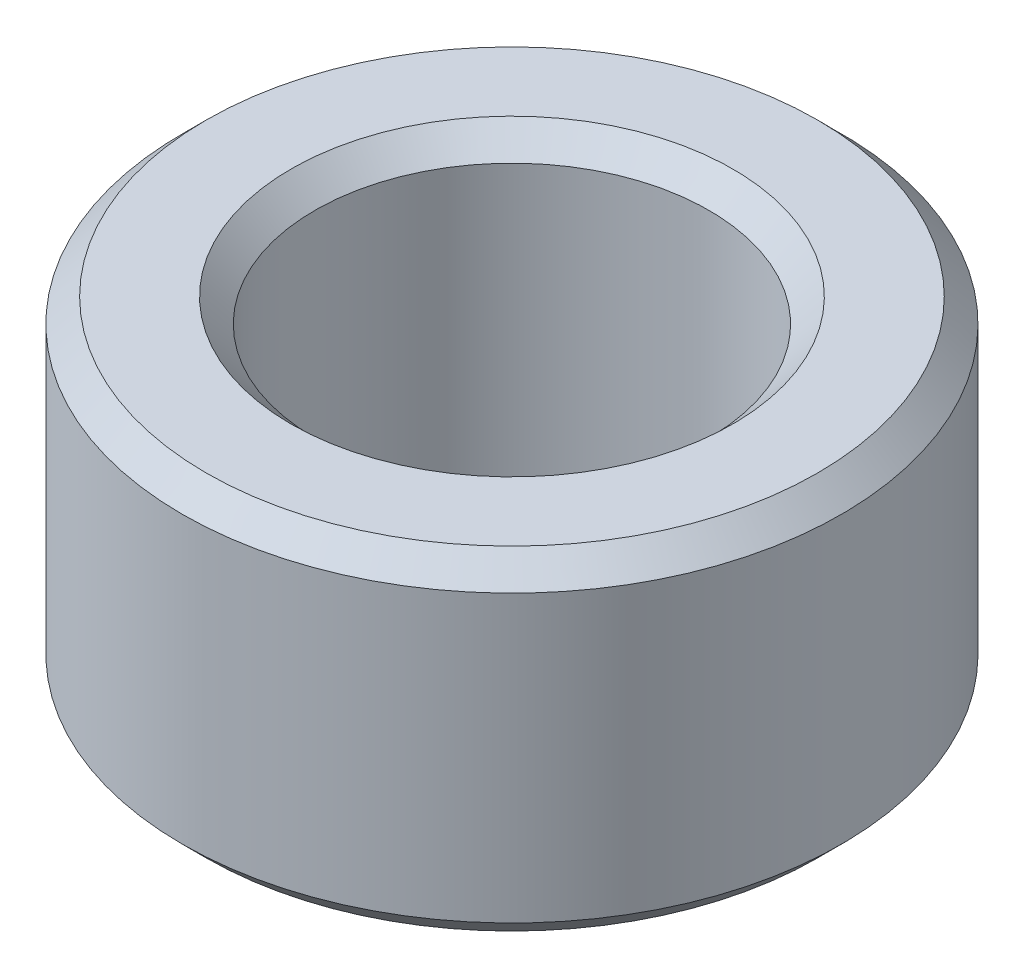
ISO-10303-21;
HEADER;
FILE_DESCRIPTION(('STEP AP214'),'2;1');
FILE_NAME('part.step','',(''),(''),'','','');
FILE_SCHEMA(('AUTOMOTIVE_DESIGN { 1 0 10303 214 1 1 1 1 }'));
ENDSEC;
DATA;
#1=APPLICATION_CONTEXT('core data for automotive mechanical design processes');
#2=APPLICATION_PROTOCOL_DEFINITION('international standard','automotive_design',2000,#1);
#3=PRODUCT_CONTEXT('',#1,'mechanical');
#4=PRODUCT('Part','Part','',(#3));
#5=PRODUCT_RELATED_PRODUCT_CATEGORY('part','',(#4));
#6=PRODUCT_DEFINITION_FORMATION('','',#4);
#7=PRODUCT_DEFINITION_CONTEXT('part definition',#1,'design');
#8=PRODUCT_DEFINITION('design','',#6,#7);
#9=PRODUCT_DEFINITION_SHAPE('','',#8);
#10=(LENGTH_UNIT() NAMED_UNIT(*) SI_UNIT(.MILLI.,.METRE.));
#11=(NAMED_UNIT(*) PLANE_ANGLE_UNIT() SI_UNIT($,.RADIAN.));
#12=(NAMED_UNIT(*) SI_UNIT($,.STERADIAN.) SOLID_ANGLE_UNIT());
#13=UNCERTAINTY_MEASURE_WITH_UNIT(LENGTH_MEASURE(1.E-05),#10,'distance_accuracy_value','');
#14=(GEOMETRIC_REPRESENTATION_CONTEXT(3) GLOBAL_UNCERTAINTY_ASSIGNED_CONTEXT((#13)) GLOBAL_UNIT_ASSIGNED_CONTEXT((#10,
#11,#12)) REPRESENTATION_CONTEXT('',''));
#15=CARTESIAN_POINT('',(0.,0.,0.));
#16=DIRECTION('',(0.,0.,1.));
#17=DIRECTION('',(1.,0.,0.));
#18=AXIS2_PLACEMENT_3D('',#15,#16,#17);
#19=CARTESIAN_POINT('',(0.,42.9916496642791,0.));
#20=DIRECTION('',(0.,-1.,0.));
#21=DIRECTION('',(0.,0.,-1.));
#22=AXIS2_PLACEMENT_3D('',#19,#20,#21);
#23=CYLINDRICAL_SURFACE('',#22,42.5);
#24=CARTESIAN_POINT('',(0.,3.07681125187531,0.));
#25=DIRECTION('',(0.,1.,0.));
#26=DIRECTION('',(0.,0.,1.));
#27=AXIS2_PLACEMENT_3D('',#24,#25,#26);
#28=CIRCLE('',#27,42.5);
#29=CARTESIAN_POINT('',(0.,3.07681125187531,42.5));
#30=VERTEX_POINT('',#29);
#31=EDGE_CURVE('E10',#30,#30,#28,.T.);
#32=ORIENTED_EDGE('',*,*,#31,.T.);
#33=EDGE_LOOP('',(#32));
#34=FACE_BOUND('',#33,.T.);
#35=CARTESIAN_POINT('',(0.,39.9148384124037,0.));
#36=DIRECTION('',(0.,1.,0.));
#37=DIRECTION('',(0.,0.,1.));
#38=AXIS2_PLACEMENT_3D('',#35,#36,#37);
#39=CIRCLE('',#38,42.5);
#40=CARTESIAN_POINT('',(0.,39.9148384124037,42.5));
#41=VERTEX_POINT('',#40);
#42=EDGE_CURVE('E50',#41,#41,#39,.F.);
#43=ORIENTED_EDGE('',*,*,#42,.T.);
#44=EDGE_LOOP('',(#43));
#45=FACE_BOUND('',#44,.T.);
#46=ADVANCED_FACE('F39',(#34,#45),#23,.T.);
#47=CARTESIAN_POINT('',(0.,42.9916496642791,0.));
#48=DIRECTION('',(0.,1.,0.));
#49=DIRECTION('',(0.,0.,1.));
#50=AXIS2_PLACEMENT_3D('',#47,#48,#49);
#51=PLANE('',#50);
#52=CARTESIAN_POINT('',(0.,42.9916496642791,0.));
#53=DIRECTION('',(0.,1.,0.));
#54=DIRECTION('',(0.,0.,1.));
#55=AXIS2_PLACEMENT_3D('',#52,#53,#54);
#56=CIRCLE('',#55,28.4883892077556);
#57=CARTESIAN_POINT('',(0.,42.9916496642791,28.4883892077556));
#58=VERTEX_POINT('',#57);
#59=EDGE_CURVE('E58',#58,#58,#56,.F.);
#60=ORIENTED_EDGE('',*,*,#59,.T.);
#61=EDGE_LOOP('',(#60));
#62=FACE_BOUND('',#61,.T.);
#63=CARTESIAN_POINT('',(0.,42.9916496642791,0.));
#64=DIRECTION('',(0.,1.,0.));
#65=DIRECTION('',(0.,0.,1.));
#66=AXIS2_PLACEMENT_3D('',#63,#64,#65);
#67=CIRCLE('',#66,39.4231887481247);
#68=CARTESIAN_POINT('',(0.,42.9916496642791,39.4231887481247));
#69=VERTEX_POINT('',#68);
#70=EDGE_CURVE('E61',#69,#69,#67,.T.);
#71=ORIENTED_EDGE('',*,*,#70,.T.);
#72=EDGE_LOOP('',(#71));
#73=FACE_BOUND('',#72,.T.);
#74=ADVANCED_FACE('F88',(#62,#73),#51,.T.);
#75=CARTESIAN_POINT('',(0.,0.,0.));
#76=DIRECTION('',(0.,1.,0.));
#77=DIRECTION('',(0.,0.,1.));
#78=AXIS2_PLACEMENT_3D('',#75,#76,#77);
#79=PLANE('',#78);
#80=CARTESIAN_POINT('',(0.,0.,0.));
#81=DIRECTION('',(0.,1.,0.));
#82=DIRECTION('',(0.,0.,1.));
#83=AXIS2_PLACEMENT_3D('',#80,#81,#82);
#84=CIRCLE('',#83,28.4883892077556);
#85=CARTESIAN_POINT('',(0.,0.,28.4883892077556));
#86=VERTEX_POINT('',#85);
#87=EDGE_CURVE('E51',#86,#86,#84,.T.);
#88=ORIENTED_EDGE('',*,*,#87,.T.);
#89=EDGE_LOOP('',(#88));
#90=FACE_BOUND('',#89,.T.);
#91=CARTESIAN_POINT('',(0.,0.,0.));
#92=DIRECTION('',(0.,1.,0.));
#93=DIRECTION('',(0.,0.,1.));
#94=AXIS2_PLACEMENT_3D('',#91,#92,#93);
#95=CIRCLE('',#94,39.4231887481247);
#96=CARTESIAN_POINT('',(0.,0.,39.4231887481247));
#97=VERTEX_POINT('',#96);
#98=EDGE_CURVE('E54',#97,#97,#95,.F.);
#99=ORIENTED_EDGE('',*,*,#98,.T.);
#100=EDGE_LOOP('',(#99));
#101=FACE_BOUND('',#100,.T.);
#102=ADVANCED_FACE('F83',(#90,#101),#79,.F.);
#103=CARTESIAN_POINT('',(0.,42.9916496642791,0.));
#104=DIRECTION('',(0.,-1.,0.));
#105=DIRECTION('',(0.,0.,-1.));
#106=AXIS2_PLACEMENT_3D('',#103,#104,#105);
#107=CYLINDRICAL_SURFACE('',#106,25.4115779558803);
#108=CARTESIAN_POINT('',(0.,39.9148384124038,0.));
#109=DIRECTION('',(0.,1.,0.));
#110=DIRECTION('',(0.,0.,1.));
#111=AXIS2_PLACEMENT_3D('',#108,#109,#110);
#112=CIRCLE('',#111,25.4115779558803);
#113=CARTESIAN_POINT('',(0.,39.9148384124038,25.4115779558803));
#114=VERTEX_POINT('',#113);
#115=EDGE_CURVE('E67',#114,#114,#112,.T.);
#116=ORIENTED_EDGE('',*,*,#115,.T.);
#117=EDGE_LOOP('',(#116));
#118=FACE_BOUND('',#117,.T.);
#119=CARTESIAN_POINT('',(0.,3.07681125187533,0.));
#120=DIRECTION('',(0.,1.,0.));
#121=DIRECTION('',(0.,0.,1.));
#122=AXIS2_PLACEMENT_3D('',#119,#120,#121);
#123=CIRCLE('',#122,25.4115779558803);
#124=CARTESIAN_POINT('',(0.,3.07681125187533,25.4115779558803));
#125=VERTEX_POINT('',#124);
#126=EDGE_CURVE('E69',#125,#125,#123,.F.);
#127=ORIENTED_EDGE('',*,*,#126,.T.);
#128=EDGE_LOOP('',(#127));
#129=FACE_BOUND('',#128,.T.);
#130=ADVANCED_FACE('F71',(#118,#129),#107,.F.);
#131=CARTESIAN_POINT('',(0.,39.9148384124038,0.));
#132=DIRECTION('',(0.,1.,0.));
#133=DIRECTION('',(0.,0.,1.));
#134=AXIS2_PLACEMENT_3D('',#131,#132,#133);
#135=CONICAL_SURFACE('',#134,25.4115779558803,0.785398163397453);
#136=CARTESIAN_POINT('',(0.,42.9916496642791,28.4883892077556));
#137=CARTESIAN_POINT('',(0.,42.959599547072,28.4563390905486));
#138=CARTESIAN_POINT('',(0.,42.927549429865,28.4242889733415));
#139=CARTESIAN_POINT('',(0.,42.8634491954509,28.3601887389274));
#140=CARTESIAN_POINT('',(0.,42.8313990782439,28.3281386217204));
#141=CARTESIAN_POINT('',(0.,42.7672988438298,28.2640383873063));
#142=CARTESIAN_POINT('',(0.,42.7352487266228,28.2319882700993));
#143=CARTESIAN_POINT('',(0.,42.6711484922087,28.1678880356852));
#144=CARTESIAN_POINT('',(0.,42.6390983750017,28.1358379184782));
#145=CARTESIAN_POINT('',(0.,42.5749981405876,28.0717376840641));
#146=CARTESIAN_POINT('',(0.,42.5429480233806,28.0396875668571));
#147=CARTESIAN_POINT('',(0.,42.4788477889665,27.975587332443));
#148=CARTESIAN_POINT('',(0.,42.4467976717595,27.943537215236));
#149=CARTESIAN_POINT('',(0.,42.3826974373454,27.8794369808219));
#150=CARTESIAN_POINT('',(0.,42.3506473201384,27.8473868636149));
#151=CARTESIAN_POINT('',(0.,42.2865470857243,27.7832866292008));
#152=CARTESIAN_POINT('',(0.,42.2544969685173,27.7512365119938));
#153=CARTESIAN_POINT('',(0.,42.1903967341032,27.6871362775797));
#154=CARTESIAN_POINT('',(0.,42.1583466168962,27.6550861603727));
#155=CARTESIAN_POINT('',(0.,42.0942463824821,27.5909859259586));
#156=CARTESIAN_POINT('',(0.,42.0621962652751,27.5589358087516));
#157=CARTESIAN_POINT('',(0.,41.998096030861,27.4948355743375));
#158=CARTESIAN_POINT('',(0.,41.966045913654,27.4627854571305));
#159=CARTESIAN_POINT('',(0.,41.9019456792399,27.3986852227164));
#160=CARTESIAN_POINT('',(0.,41.8698955620329,27.3666351055094));
#161=CARTESIAN_POINT('',(0.,41.8057953276188,27.3025348710953));
#162=CARTESIAN_POINT('',(0.,41.7737452104118,27.2704847538883));
#163=CARTESIAN_POINT('',(0.,41.7096449759977,27.2063845194742));
#164=CARTESIAN_POINT('',(0.,41.6775948587906,27.1743344022672));
#165=CARTESIAN_POINT('',(0.,41.6134946243766,27.1102341678531));
#166=CARTESIAN_POINT('',(0.,41.5814445071695,27.0781840506461));
#167=CARTESIAN_POINT('',(0.,41.5173442727555,27.014083816232));
#168=CARTESIAN_POINT('',(0.,41.4852941555484,26.982033699025));
#169=CARTESIAN_POINT('',(0.,41.4211939211344,26.9179334646109));
#170=CARTESIAN_POINT('',(0.,41.3891438039273,26.8858833474039));
#171=CARTESIAN_POINT('',(0.,41.3250435695133,26.8217831129898));
#172=CARTESIAN_POINT('',(0.,41.2929934523062,26.7897329957827));
#173=CARTESIAN_POINT('',(0.,41.2288932178922,26.7256327613687));
#174=CARTESIAN_POINT('',(0.,41.1968431006851,26.6935826441616));
#175=CARTESIAN_POINT('',(0.,41.1327428662711,26.6294824097476));
#176=CARTESIAN_POINT('',(0.,41.100692749064,26.5974322925405));
#177=CARTESIAN_POINT('',(0.,41.03659251465,26.5333320581265));
#178=CARTESIAN_POINT('',(0.,41.0045423974429,26.5012819409194));
#179=CARTESIAN_POINT('',(0.,40.9404421630289,26.4371817065054));
#180=CARTESIAN_POINT('',(0.,40.9083920458218,26.4051315892983));
#181=CARTESIAN_POINT('',(0.,40.8442918114078,26.3410313548843));
#182=CARTESIAN_POINT('',(0.,40.8122416942007,26.3089812376772));
#183=CARTESIAN_POINT('',(0.,40.7481414597867,26.2448810032632));
#184=CARTESIAN_POINT('',(0.,40.7160913425796,26.2128308860561));
#185=CARTESIAN_POINT('',(0.,40.6519911081656,26.1487306516421));
#186=CARTESIAN_POINT('',(0.,40.6199409909585,26.116680534435));
#187=CARTESIAN_POINT('',(0.,40.5558407565444,26.052580300021));
#188=CARTESIAN_POINT('',(0.,40.5237906393374,26.0205301828139));
#189=CARTESIAN_POINT('',(0.,40.4596904049233,25.9564299483998));
#190=CARTESIAN_POINT('',(0.,40.4276402877163,25.9243798311928));
#191=CARTESIAN_POINT('',(0.,40.3635400533022,25.8602795967787));
#192=CARTESIAN_POINT('',(0.,40.3314899360952,25.8282294795717));
#193=CARTESIAN_POINT('',(0.,40.2673897016811,25.7641292451576));
#194=CARTESIAN_POINT('',(0.,40.2353395844741,25.7320791279506));
#195=CARTESIAN_POINT('',(0.,40.17123935006,25.6679788935365));
#196=CARTESIAN_POINT('',(0.,40.139189232853,25.6359287763295));
#197=CARTESIAN_POINT('',(0.,40.0750889984389,25.5718285419154));
#198=CARTESIAN_POINT('',(0.,40.0430388812319,25.5397784247084));
#199=CARTESIAN_POINT('',(0.,39.9789386468178,25.4756781902943));
#200=CARTESIAN_POINT('',(0.,39.9468885296108,25.4436280730873));
#201=CARTESIAN_POINT('',(0.,39.9148384124038,25.4115779558803));
#202=B_SPLINE_CURVE_WITH_KNOTS('',3,(#136,#137,#138,#139,#140,#141,#142,#143,#144,#145,#146,
#147,#148,#149,#150,#151,#152,#153,#154,#155,#156,#157,#158,#159,#160,#161,#162,#163,#164,#165,
#166,#167,#168,#169,#170,#171,#172,#173,#174,#175,#176,#177,#178,#179,#180,#181,#182,#183,#184,
#185,#186,#187,#188,#189,#190,#191,#192,#193,#194,#195,#196,#197,#198,#199,#200,#201),
.UNSPECIFIED.,.F.,.F.,(4,2,2,2,2,2,2,2,2,2,2,2,2,2,2,2,2,2,2,2,2,2,2,2,2,2,2,2,2,2,2,2,4),(0.,
0.135977131289506,0.271954262579013,0.407931393868519,0.543908525158026,0.679885656447535,
0.815862787737041,0.951839919026548,1.08781705031605,1.22379418160556,1.35977131289507,
1.49574844418458,1.63172557547408,1.76770270676359,1.90367983805309,2.0396569693426,
2.1756341006321,2.31161123192161,2.44758836321112,2.58356549450063,2.71954262579013,
2.85551975707964,2.99149688836914,3.12747401965865,3.26345115094816,3.39942828223767,
3.53540541352717,3.67138254481668,3.80735967610619,3.94333680739569,4.0793139386852,
4.21529106997471,4.35126820126421),.UNSPECIFIED.);
#203=EDGE_CURVE('BSEAM77',#58,#114,#202,.T.);
#204=ORIENTED_EDGE('',*,*,#59,.F.);
#205=ORIENTED_EDGE('',*,*,#115,.F.);
#206=ORIENTED_EDGE('',*,*,#203,.T.);
#207=ORIENTED_EDGE('',*,*,#203,.F.);
#208=EDGE_LOOP('',(#204,#206,#205,#207));
#209=FACE_BOUND('',#208,.T.);
#210=ADVANCED_FACE('F77',(#209),#135,.F.);
#211=CARTESIAN_POINT('',(0.,0.,0.));
#212=DIRECTION('',(0.,-1.,0.));
#213=DIRECTION('',(0.,0.,-1.));
#214=AXIS2_PLACEMENT_3D('',#211,#212,#213);
#215=CONICAL_SURFACE('',#214,28.4883892077556,0.785398163397444);
#216=ORIENTED_EDGE('',*,*,#126,.F.);
#217=EDGE_LOOP('',(#216));
#218=FACE_BOUND('',#217,.T.);
#219=ORIENTED_EDGE('',*,*,#87,.F.);
#220=EDGE_LOOP('',(#219));
#221=FACE_BOUND('',#220,.T.);
#222=ADVANCED_FACE('F73',(#218,#221),#215,.F.);
#223=CARTESIAN_POINT('',(0.,3.07681125187531,0.));
#224=DIRECTION('',(0.,1.,0.));
#225=DIRECTION('',(0.,0.,1.));
#226=AXIS2_PLACEMENT_3D('',#223,#224,#225);
#227=CONICAL_SURFACE('',#226,42.5,0.785398163397452);
#228=ORIENTED_EDGE('',*,*,#98,.F.);
#229=EDGE_LOOP('',(#228));
#230=FACE_BOUND('',#229,.T.);
#231=ORIENTED_EDGE('',*,*,#31,.F.);
#232=EDGE_LOOP('',(#231));
#233=FACE_BOUND('',#232,.T.);
#234=ADVANCED_FACE('F76',(#230,#233),#227,.T.);
#235=CARTESIAN_POINT('',(0.,42.9916496642791,0.));
#236=DIRECTION('',(0.,-1.,0.));
#237=DIRECTION('',(0.,0.,-1.));
#238=AXIS2_PLACEMENT_3D('',#235,#236,#237);
#239=CONICAL_SURFACE('',#238,39.4231887481247,0.785398163397446);
#240=ORIENTED_EDGE('',*,*,#42,.F.);
#241=EDGE_LOOP('',(#240));
#242=FACE_BOUND('',#241,.T.);
#243=ORIENTED_EDGE('',*,*,#70,.F.);
#244=EDGE_LOOP('',(#243));
#245=FACE_BOUND('',#244,.T.);
#246=ADVANCED_FACE('F45',(#242,#245),#239,.T.);
#247=CLOSED_SHELL('',(#46,#74,#102,#130,#210,#222,#234,#246));
#248=MANIFOLD_SOLID_BREP('B2',#247);
#249=ADVANCED_BREP_SHAPE_REPRESENTATION('',(#18,#248),#14);
#250=SHAPE_DEFINITION_REPRESENTATION(#9,#249);
ENDSEC;
END-ISO-10303-21;
